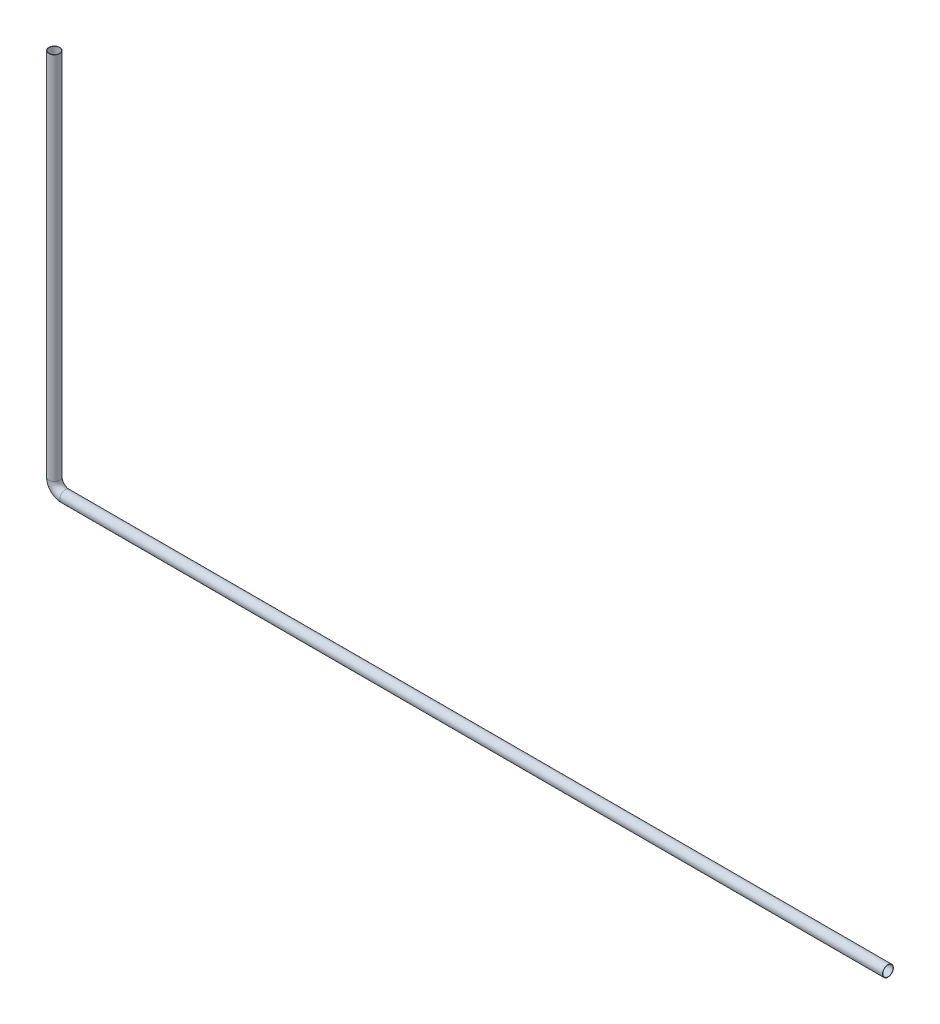
ISO-10303-21;
HEADER;
FILE_DESCRIPTION(('STEP AP214'),'2;1');
FILE_NAME('part.step','',(''),(''),'','','');
FILE_SCHEMA(('AUTOMOTIVE_DESIGN { 1 0 10303 214 1 1 1 1 }'));
ENDSEC;
DATA;
#1=APPLICATION_CONTEXT('core data for automotive mechanical design processes');
#2=APPLICATION_PROTOCOL_DEFINITION('international standard','automotive_design',2000,#1);
#3=PRODUCT_CONTEXT('',#1,'mechanical');
#4=PRODUCT('Part','Part','',(#3));
#5=PRODUCT_RELATED_PRODUCT_CATEGORY('part','',(#4));
#6=PRODUCT_DEFINITION_FORMATION('','',#4);
#7=PRODUCT_DEFINITION_CONTEXT('part definition',#1,'design');
#8=PRODUCT_DEFINITION('design','',#6,#7);
#9=PRODUCT_DEFINITION_SHAPE('','',#8);
#10=(LENGTH_UNIT() NAMED_UNIT(*) SI_UNIT(.MILLI.,.METRE.));
#11=(NAMED_UNIT(*) PLANE_ANGLE_UNIT() SI_UNIT($,.RADIAN.));
#12=(NAMED_UNIT(*) SI_UNIT($,.STERADIAN.) SOLID_ANGLE_UNIT());
#13=UNCERTAINTY_MEASURE_WITH_UNIT(LENGTH_MEASURE(1.E-05),#10,'distance_accuracy_value','');
#14=(GEOMETRIC_REPRESENTATION_CONTEXT(3) GLOBAL_UNCERTAINTY_ASSIGNED_CONTEXT((#13)) GLOBAL_UNIT_ASSIGNED_CONTEXT((#10,
#11,#12)) REPRESENTATION_CONTEXT('',''));
#15=CARTESIAN_POINT('',(0.,0.,0.));
#16=DIRECTION('',(0.,0.,1.));
#17=DIRECTION('',(1.,0.,0.));
#18=AXIS2_PLACEMENT_3D('',#15,#16,#17);
#19=CARTESIAN_POINT('',(-34220.2160646753,-16256.7025632948,40211.5777126254));
#20=DIRECTION('',(0.,1.,0.));
#21=DIRECTION('',(0.,0.,1.));
#22=AXIS2_PLACEMENT_3D('',#19,#20,#21);
#23=PLANE('',#22);
#24=CARTESIAN_POINT('',(-34220.2160646753,-16256.7025632948,40211.5777126254));
#25=DIRECTION('',(0.,1.,0.));
#26=DIRECTION('',(0.,0.,1.));
#27=AXIS2_PLACEMENT_3D('',#24,#25,#26);
#28=CIRCLE('',#27,14.0000000000006);
#29=CARTESIAN_POINT('',(-34220.2160646753,-16256.7025632948,40225.5777126254));
#30=VERTEX_POINT('',#29);
#31=EDGE_CURVE('E73',#30,#30,#28,.T.);
#32=ORIENTED_EDGE('',*,*,#31,.F.);
#33=EDGE_LOOP('',(#32));
#34=FACE_BOUND('',#33,.T.);
#35=CARTESIAN_POINT('',(-34220.2160646753,-16256.7025632948,40211.5777126254));
#36=DIRECTION('',(0.,1.,0.));
#37=DIRECTION('',(0.,0.,1.));
#38=AXIS2_PLACEMENT_3D('',#35,#36,#37);
#39=CIRCLE('',#38,15.0000000000006);
#40=CARTESIAN_POINT('',(-34220.2160646753,-16256.7025632948,40226.5777126254));
#41=VERTEX_POINT('',#40);
#42=EDGE_CURVE('E64',#41,#41,#39,.T.);
#43=ORIENTED_EDGE('',*,*,#42,.T.);
#44=EDGE_LOOP('',(#43));
#45=FACE_BOUND('',#44,.T.);
#46=ADVANCED_FACE('F50',(#34,#45),#23,.T.);
#47=CARTESIAN_POINT('',(-31937.4492832491,-17298.2109322222,40211.5777126254));
#48=DIRECTION('',(-1.,0.,0.));
#49=DIRECTION('',(0.,0.,1.));
#50=AXIS2_PLACEMENT_3D('',#47,#48,#49);
#51=PLANE('',#50);
#52=CARTESIAN_POINT('',(-31937.4492832491,-17298.2109322222,40211.5777126254));
#53=DIRECTION('',(-1.,0.,0.));
#54=DIRECTION('',(0.,0.,1.));
#55=AXIS2_PLACEMENT_3D('',#52,#53,#54);
#56=CIRCLE('',#55,14.0000000000006);
#57=CARTESIAN_POINT('',(-31937.4492832491,-17298.2109322222,40225.5777126254));
#58=VERTEX_POINT('',#57);
#59=EDGE_CURVE('E69',#58,#58,#56,.T.);
#60=ORIENTED_EDGE('',*,*,#59,.T.);
#61=EDGE_LOOP('',(#60));
#62=FACE_BOUND('',#61,.T.);
#63=CARTESIAN_POINT('',(-31937.4492832491,-17298.2109322222,40211.5777126254));
#64=DIRECTION('',(-1.,0.,0.));
#65=DIRECTION('',(0.,0.,1.));
#66=AXIS2_PLACEMENT_3D('',#63,#64,#65);
#67=CIRCLE('',#66,15.0000000000006);
#68=CARTESIAN_POINT('',(-31937.4492832491,-17298.2109322222,40226.5777126254));
#69=VERTEX_POINT('',#68);
#70=EDGE_CURVE('E11',#69,#69,#67,.T.);
#71=ORIENTED_EDGE('',*,*,#70,.F.);
#72=EDGE_LOOP('',(#71));
#73=FACE_BOUND('',#72,.T.);
#74=ADVANCED_FACE('F93',(#62,#73),#51,.F.);
#75=CARTESIAN_POINT('',(-34220.2160646753,-16256.7025632948,40211.5777126254));
#76=DIRECTION('',(0.,-1.,0.));
#77=DIRECTION('',(0.,0.,-1.));
#78=AXIS2_PLACEMENT_3D('',#75,#76,#77);
#79=CYLINDRICAL_SURFACE('',#78,15.0000000000006);
#80=CARTESIAN_POINT('',(-34220.2160646753,-17268.2109322222,40211.5777126254));
#81=DIRECTION('',(0.,1.,0.));
#82=DIRECTION('',(0.,0.,1.));
#83=AXIS2_PLACEMENT_3D('',#80,#81,#82);
#84=CIRCLE('',#83,15.0000000000006);
#85=CARTESIAN_POINT('',(-34235.2160646753,-17268.2109322222,40211.5777126254));
#86=VERTEX_POINT('',#85);
#87=EDGE_CURVE('E60',#86,#86,#84,.T.);
#88=ORIENTED_EDGE('',*,*,#87,.T.);
#89=EDGE_LOOP('',(#88));
#90=FACE_BOUND('',#89,.T.);
#91=ORIENTED_EDGE('',*,*,#42,.F.);
#92=EDGE_LOOP('',(#91));
#93=FACE_BOUND('',#92,.T.);
#94=ADVANCED_FACE('F97',(#90,#93),#79,.T.);
#95=CARTESIAN_POINT('',(-34190.2160646753,-17268.2109322222,40211.5777126254));
#96=DIRECTION('',(0.,0.,1.));
#97=DIRECTION('',(1.,0.,0.));
#98=AXIS2_PLACEMENT_3D('',#95,#96,#97);
#99=TOROIDAL_SURFACE('',#98,30.0000000000011,15.0000000000006);
#100=CARTESIAN_POINT('',(-34190.2160646753,-17298.2109322222,40211.5777126254));
#101=DIRECTION('',(-1.,0.,0.));
#102=DIRECTION('',(0.,0.,1.));
#103=AXIS2_PLACEMENT_3D('',#100,#101,#102);
#104=CIRCLE('',#103,15.0000000000006);
#105=CARTESIAN_POINT('',(-34190.2160646753,-17313.2109322222,40211.5777126254));
#106=VERTEX_POINT('',#105);
#107=EDGE_CURVE('E56',#106,#106,#104,.T.);
#108=CARTESIAN_POINT('',(-34190.2160646753,-17268.2109322222,40211.5777126254));
#109=DIRECTION('',(0.,0.,1.));
#110=DIRECTION('',(1.,0.,0.));
#111=AXIS2_PLACEMENT_3D('',#108,#109,#110);
#112=CIRCLE('',#111,45.0000000000017);
#113=EDGE_CURVE('',#86,#106,#112,.T.);
#114=ORIENTED_EDGE('',*,*,#87,.F.);
#115=ORIENTED_EDGE('',*,*,#107,.T.);
#116=ORIENTED_EDGE('',*,*,#113,.T.);
#117=ORIENTED_EDGE('',*,*,#113,.F.);
#118=EDGE_LOOP('',(#114,#116,#115,#117));
#119=FACE_BOUND('',#118,.T.);
#120=ADVANCED_FACE('F99',(#119),#99,.T.);
#121=CARTESIAN_POINT('',(-34190.2160646753,-17298.2109322222,40211.5777126254));
#122=DIRECTION('',(1.,0.,0.));
#123=DIRECTION('',(0.,0.,-1.));
#124=AXIS2_PLACEMENT_3D('',#121,#122,#123);
#125=CYLINDRICAL_SURFACE('',#124,15.0000000000006);
#126=ORIENTED_EDGE('',*,*,#70,.T.);
#127=EDGE_LOOP('',(#126));
#128=FACE_BOUND('',#127,.T.);
#129=ORIENTED_EDGE('',*,*,#107,.F.);
#130=EDGE_LOOP('',(#129));
#131=FACE_BOUND('',#130,.T.);
#132=ADVANCED_FACE('F87',(#128,#131),#125,.T.);
#133=CARTESIAN_POINT('',(-34220.2160646753,-16256.7025632948,40211.5777126254));
#134=DIRECTION('',(0.,-1.,0.));
#135=DIRECTION('',(0.,0.,-1.));
#136=AXIS2_PLACEMENT_3D('',#133,#134,#135);
#137=CYLINDRICAL_SURFACE('',#136,14.0000000000006);
#138=CARTESIAN_POINT('',(-34220.2160646753,-17268.2109322222,40211.5777126254));
#139=DIRECTION('',(0.,-1.,0.));
#140=DIRECTION('',(0.,0.,-1.));
#141=AXIS2_PLACEMENT_3D('',#138,#139,#140);
#142=CIRCLE('',#141,14.0000000000006);
#143=CARTESIAN_POINT('',(-34234.2160646753,-17268.2109322222,40211.5777126254));
#144=VERTEX_POINT('',#143);
#145=EDGE_CURVE('E76',#144,#144,#142,.F.);
#146=ORIENTED_EDGE('',*,*,#145,.F.);
#147=EDGE_LOOP('',(#146));
#148=FACE_BOUND('',#147,.T.);
#149=ORIENTED_EDGE('',*,*,#31,.T.);
#150=EDGE_LOOP('',(#149));
#151=FACE_BOUND('',#150,.T.);
#152=ADVANCED_FACE('F84',(#148,#151),#137,.F.);
#153=CARTESIAN_POINT('',(-34190.2160646753,-17268.2109322222,40211.5777126254));
#154=DIRECTION('',(0.,0.,1.));
#155=DIRECTION('',(1.,0.,0.));
#156=AXIS2_PLACEMENT_3D('',#153,#154,#155);
#157=TOROIDAL_SURFACE('',#156,30.0000000000011,14.0000000000006);
#158=CARTESIAN_POINT('',(-34190.2160646753,-17298.2109322222,40211.5777126254));
#159=DIRECTION('',(-1.,0.,0.));
#160=DIRECTION('',(0.,-1.,0.));
#161=AXIS2_PLACEMENT_3D('',#158,#159,#160);
#162=CIRCLE('',#161,14.0000000000006);
#163=CARTESIAN_POINT('',(-34190.2160646753,-17312.2109322222,40211.5777126254));
#164=VERTEX_POINT('',#163);
#165=EDGE_CURVE('E72',#164,#164,#162,.T.);
#166=CARTESIAN_POINT('',(-34190.2160646753,-17268.2109322222,40211.5777126254));
#167=DIRECTION('',(0.,0.,1.));
#168=DIRECTION('',(1.,0.,0.));
#169=AXIS2_PLACEMENT_3D('',#166,#167,#168);
#170=CIRCLE('',#169,44.0000000000017);
#171=EDGE_CURVE('',#144,#164,#170,.T.);
#172=ORIENTED_EDGE('',*,*,#145,.T.);
#173=ORIENTED_EDGE('',*,*,#165,.F.);
#174=ORIENTED_EDGE('',*,*,#171,.T.);
#175=ORIENTED_EDGE('',*,*,#171,.F.);
#176=EDGE_LOOP('',(#172,#174,#173,#175));
#177=FACE_BOUND('',#176,.T.);
#178=ADVANCED_FACE('F82',(#177),#157,.F.);
#179=CARTESIAN_POINT('',(-34190.2160646753,-17298.2109322222,40211.5777126254));
#180=DIRECTION('',(1.,0.,0.));
#181=DIRECTION('',(0.,0.,-1.));
#182=AXIS2_PLACEMENT_3D('',#179,#180,#181);
#183=CYLINDRICAL_SURFACE('',#182,14.0000000000006);
#184=ORIENTED_EDGE('',*,*,#59,.F.);
#185=EDGE_LOOP('',(#184));
#186=FACE_BOUND('',#185,.T.);
#187=ORIENTED_EDGE('',*,*,#165,.T.);
#188=EDGE_LOOP('',(#187));
#189=FACE_BOUND('',#188,.T.);
#190=ADVANCED_FACE('F94',(#186,#189),#183,.F.);
#191=CLOSED_SHELL('',(#46,#74,#94,#120,#132,#152,#178,#190));
#192=MANIFOLD_SOLID_BREP('B2',#191);
#193=ADVANCED_BREP_SHAPE_REPRESENTATION('',(#18,#192),#14);
#194=SHAPE_DEFINITION_REPRESENTATION(#9,#193);
ENDSEC;
END-ISO-10303-21;
